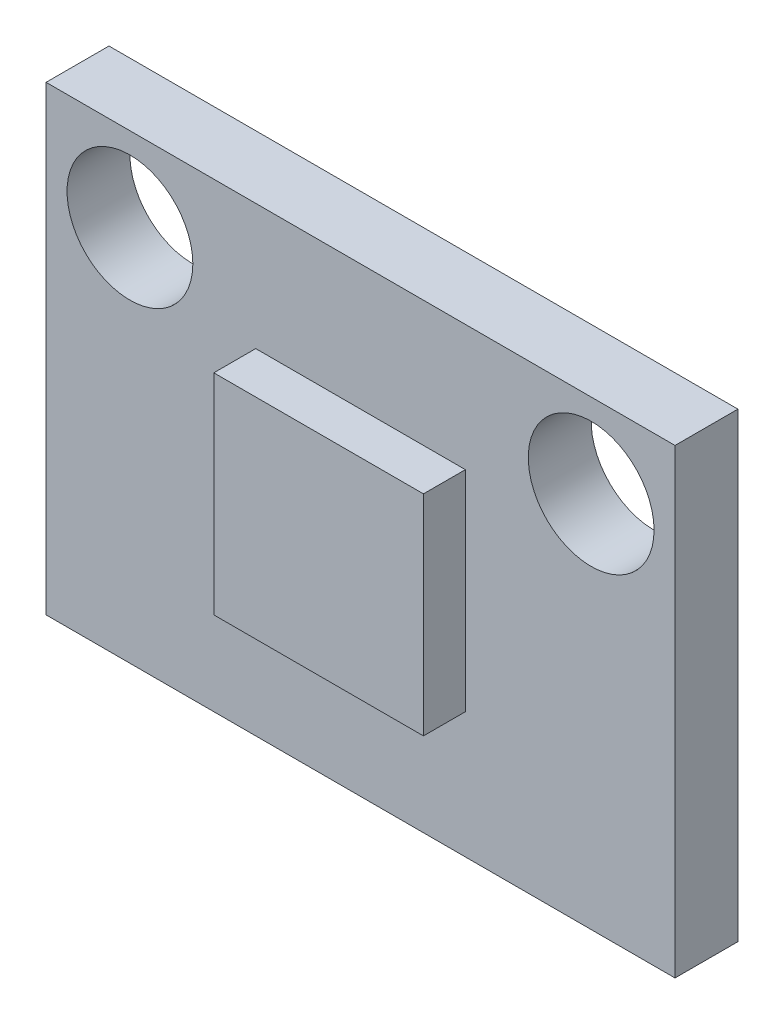
ISO-10303-21;
HEADER;
FILE_DESCRIPTION(('STEP AP214'),'2;1');
FILE_NAME('part.step','',(''),(''),'','','');
FILE_SCHEMA(('AUTOMOTIVE_DESIGN { 1 0 10303 214 1 1 1 1 }'));
ENDSEC;
DATA;
#1=APPLICATION_CONTEXT('core data for automotive mechanical design processes');
#2=APPLICATION_PROTOCOL_DEFINITION('international standard','automotive_design',2000,#1);
#3=PRODUCT_CONTEXT('',#1,'mechanical');
#4=PRODUCT('Part','Part','',(#3));
#5=PRODUCT_RELATED_PRODUCT_CATEGORY('part','',(#4));
#6=PRODUCT_DEFINITION_FORMATION('','',#4);
#7=PRODUCT_DEFINITION_CONTEXT('part definition',#1,'design');
#8=PRODUCT_DEFINITION('design','',#6,#7);
#9=PRODUCT_DEFINITION_SHAPE('','',#8);
#10=(LENGTH_UNIT() NAMED_UNIT(*) SI_UNIT(.MILLI.,.METRE.));
#11=(NAMED_UNIT(*) PLANE_ANGLE_UNIT() SI_UNIT($,.RADIAN.));
#12=(NAMED_UNIT(*) SI_UNIT($,.STERADIAN.) SOLID_ANGLE_UNIT());
#13=UNCERTAINTY_MEASURE_WITH_UNIT(LENGTH_MEASURE(1.E-05),#10,'distance_accuracy_value','');
#14=(GEOMETRIC_REPRESENTATION_CONTEXT(3) GLOBAL_UNCERTAINTY_ASSIGNED_CONTEXT((#13)) GLOBAL_UNIT_ASSIGNED_CONTEXT((#10,
#11,#12)) REPRESENTATION_CONTEXT('',''));
#15=CARTESIAN_POINT('',(0.,0.,0.));
#16=DIRECTION('',(0.,0.,1.));
#17=DIRECTION('',(1.,0.,0.));
#18=AXIS2_PLACEMENT_3D('',#15,#16,#17);
#19=CARTESIAN_POINT('',(0.,0.,1.5));
#20=DIRECTION('',(0.,0.,1.));
#21=DIRECTION('',(1.,0.,0.));
#22=AXIS2_PLACEMENT_3D('',#19,#20,#21);
#23=PLANE('',#22);
#24=CARTESIAN_POINT('',(-5.5,3.5,1.5));
#25=DIRECTION('',(0.,0.,1.));
#26=DIRECTION('',(1.,0.,0.));
#27=AXIS2_PLACEMENT_3D('',#24,#25,#26);
#28=CIRCLE('',#27,1.5);
#29=CARTESIAN_POINT('',(-4.,3.5,1.5));
#30=VERTEX_POINT('',#29);
#31=EDGE_CURVE('E148',#30,#30,#28,.T.);
#32=ORIENTED_EDGE('',*,*,#31,.F.);
#33=EDGE_LOOP('',(#32));
#34=FACE_BOUND('',#33,.T.);
#35=DIRECTION('',(0.,-1.,0.));
#36=VECTOR('',#35,1.);
#37=CARTESIAN_POINT('',(-7.5,-5.5,1.5));
#38=LINE('',#37,#36);
#39=CARTESIAN_POINT('',(-7.5,5.5,1.5));
#40=VERTEX_POINT('',#39);
#41=CARTESIAN_POINT('',(-7.5,-5.5,1.5));
#42=VERTEX_POINT('',#41);
#43=EDGE_CURVE('E156',#40,#42,#38,.T.);
#44=ORIENTED_EDGE('',*,*,#43,.T.);
#45=DIRECTION('',(1.,0.,0.));
#46=VECTOR('',#45,1.);
#47=CARTESIAN_POINT('',(7.5,-5.5,1.5));
#48=LINE('',#47,#46);
#49=CARTESIAN_POINT('',(7.5,-5.5,1.5));
#50=VERTEX_POINT('',#49);
#51=EDGE_CURVE('E88',#42,#50,#48,.T.);
#52=ORIENTED_EDGE('',*,*,#51,.T.);
#53=DIRECTION('',(0.,1.,0.));
#54=VECTOR('',#53,1.);
#55=CARTESIAN_POINT('',(7.5,-5.5,1.5));
#56=LINE('',#55,#54);
#57=CARTESIAN_POINT('',(7.5,5.5,1.5));
#58=VERTEX_POINT('',#57);
#59=EDGE_CURVE('E161',#50,#58,#56,.T.);
#60=ORIENTED_EDGE('',*,*,#59,.T.);
#61=DIRECTION('',(-1.,0.,0.));
#62=VECTOR('',#61,1.);
#63=CARTESIAN_POINT('',(7.5,5.5,1.5));
#64=LINE('',#63,#62);
#65=EDGE_CURVE('E60',#58,#40,#64,.T.);
#66=ORIENTED_EDGE('',*,*,#65,.T.);
#67=EDGE_LOOP('',(#44,#52,#60,#66));
#68=FACE_BOUND('',#67,.T.);
#69=CARTESIAN_POINT('',(5.5,3.5,1.5));
#70=DIRECTION('',(0.,0.,1.));
#71=DIRECTION('',(1.,0.,0.));
#72=AXIS2_PLACEMENT_3D('',#69,#70,#71);
#73=CIRCLE('',#72,1.5);
#74=CARTESIAN_POINT('',(7.,3.5,1.5));
#75=VERTEX_POINT('',#74);
#76=EDGE_CURVE('E139',#75,#75,#73,.T.);
#77=ORIENTED_EDGE('',*,*,#76,.F.);
#78=EDGE_LOOP('',(#77));
#79=FACE_BOUND('',#78,.T.);
#80=DIRECTION('',(1.,0.,0.));
#81=VECTOR('',#80,1.);
#82=CARTESIAN_POINT('',(2.5,-2.5,1.5));
#83=LINE('',#82,#81);
#84=CARTESIAN_POINT('',(-2.5,-2.5,1.5));
#85=VERTEX_POINT('',#84);
#86=CARTESIAN_POINT('',(2.5,-2.5,1.5));
#87=VERTEX_POINT('',#86);
#88=EDGE_CURVE('E305',#85,#87,#83,.T.);
#89=ORIENTED_EDGE('',*,*,#88,.F.);
#90=DIRECTION('',(0.,-1.,0.));
#91=VECTOR('',#90,1.);
#92=CARTESIAN_POINT('',(-2.5,-2.5,1.5));
#93=LINE('',#92,#91);
#94=CARTESIAN_POINT('',(-2.5,2.5,1.5));
#95=VERTEX_POINT('',#94);
#96=EDGE_CURVE('E133',#95,#85,#93,.T.);
#97=ORIENTED_EDGE('',*,*,#96,.F.);
#98=DIRECTION('',(-1.,0.,0.));
#99=VECTOR('',#98,1.);
#100=CARTESIAN_POINT('',(2.5,2.5,1.5));
#101=LINE('',#100,#99);
#102=CARTESIAN_POINT('',(2.5,2.5,1.5));
#103=VERTEX_POINT('',#102);
#104=EDGE_CURVE('E129',#103,#95,#101,.T.);
#105=ORIENTED_EDGE('',*,*,#104,.F.);
#106=DIRECTION('',(0.,1.,0.));
#107=VECTOR('',#106,1.);
#108=CARTESIAN_POINT('',(2.5,-2.5,1.5));
#109=LINE('',#108,#107);
#110=EDGE_CURVE('E302',#87,#103,#109,.T.);
#111=ORIENTED_EDGE('',*,*,#110,.F.);
#112=EDGE_LOOP('',(#89,#97,#105,#111));
#113=FACE_BOUND('',#112,.T.);
#114=ADVANCED_FACE('F36',(#34,#68,#79,#113),#23,.T.);
#115=CARTESIAN_POINT('',(0.,0.,0.));
#116=DIRECTION('',(0.,0.,1.));
#117=DIRECTION('',(1.,0.,0.));
#118=AXIS2_PLACEMENT_3D('',#115,#116,#117);
#119=PLANE('',#118);
#120=DIRECTION('',(0.,-1.,0.));
#121=VECTOR('',#120,1.);
#122=CARTESIAN_POINT('',(-7.5,-5.5,0.));
#123=LINE('',#122,#121);
#124=CARTESIAN_POINT('',(-7.5,5.5,0.));
#125=VERTEX_POINT('',#124);
#126=CARTESIAN_POINT('',(-7.5,-5.5,0.));
#127=VERTEX_POINT('',#126);
#128=EDGE_CURVE('E152',#125,#127,#123,.T.);
#129=ORIENTED_EDGE('',*,*,#128,.F.);
#130=DIRECTION('',(-1.,0.,0.));
#131=VECTOR('',#130,1.);
#132=CARTESIAN_POINT('',(7.5,5.5,0.));
#133=LINE('',#132,#131);
#134=CARTESIAN_POINT('',(7.5,5.5,0.));
#135=VERTEX_POINT('',#134);
#136=EDGE_CURVE('E81',#135,#125,#133,.T.);
#137=ORIENTED_EDGE('',*,*,#136,.F.);
#138=DIRECTION('',(0.,1.,0.));
#139=VECTOR('',#138,1.);
#140=CARTESIAN_POINT('',(7.5,-5.5,0.));
#141=LINE('',#140,#139);
#142=CARTESIAN_POINT('',(7.5,-5.5,0.));
#143=VERTEX_POINT('',#142);
#144=EDGE_CURVE('E172',#143,#135,#141,.T.);
#145=ORIENTED_EDGE('',*,*,#144,.F.);
#146=DIRECTION('',(1.,0.,0.));
#147=VECTOR('',#146,1.);
#148=CARTESIAN_POINT('',(7.5,-5.5,0.));
#149=LINE('',#148,#147);
#150=EDGE_CURVE('E169',#127,#143,#149,.T.);
#151=ORIENTED_EDGE('',*,*,#150,.F.);
#152=EDGE_LOOP('',(#129,#137,#145,#151));
#153=FACE_BOUND('',#152,.T.);
#154=CARTESIAN_POINT('',(-5.5,3.5,0.));
#155=DIRECTION('',(0.,0.,1.));
#156=DIRECTION('',(1.,0.,0.));
#157=AXIS2_PLACEMENT_3D('',#154,#155,#156);
#158=CIRCLE('',#157,1.5);
#159=CARTESIAN_POINT('',(-4.,3.5,0.));
#160=VERTEX_POINT('',#159);
#161=EDGE_CURVE('E146',#160,#160,#158,.T.);
#162=ORIENTED_EDGE('',*,*,#161,.T.);
#163=EDGE_LOOP('',(#162));
#164=FACE_BOUND('',#163,.T.);
#165=CARTESIAN_POINT('',(5.5,3.5,0.));
#166=DIRECTION('',(0.,0.,1.));
#167=DIRECTION('',(1.,0.,0.));
#168=AXIS2_PLACEMENT_3D('',#165,#166,#167);
#169=CIRCLE('',#168,1.5);
#170=CARTESIAN_POINT('',(7.,3.5,0.));
#171=VERTEX_POINT('',#170);
#172=EDGE_CURVE('E135',#171,#171,#169,.T.);
#173=ORIENTED_EDGE('',*,*,#172,.T.);
#174=EDGE_LOOP('',(#173));
#175=FACE_BOUND('',#174,.T.);
#176=ADVANCED_FACE('F187',(#153,#164,#175),#119,.F.);
#177=CARTESIAN_POINT('',(-7.5,-5.5,1.5));
#178=DIRECTION('',(1.,0.,0.));
#179=DIRECTION('',(0.,0.,-1.));
#180=AXIS2_PLACEMENT_3D('',#177,#178,#179);
#181=PLANE('',#180);
#182=ORIENTED_EDGE('',*,*,#128,.T.);
#183=DIRECTION('',(0.,0.,-1.));
#184=VECTOR('',#183,1.);
#185=CARTESIAN_POINT('',(-7.5,-5.5,1.5));
#186=LINE('',#185,#184);
#187=EDGE_CURVE('E11',#42,#127,#186,.T.);
#188=ORIENTED_EDGE('',*,*,#187,.F.);
#189=ORIENTED_EDGE('',*,*,#43,.F.);
#190=DIRECTION('',(0.,0.,-1.));
#191=VECTOR('',#190,1.);
#192=CARTESIAN_POINT('',(-7.5,5.5,1.5));
#193=LINE('',#192,#191);
#194=EDGE_CURVE('E166',#40,#125,#193,.T.);
#195=ORIENTED_EDGE('',*,*,#194,.T.);
#196=EDGE_LOOP('',(#182,#188,#189,#195));
#197=FACE_BOUND('',#196,.T.);
#198=ADVANCED_FACE('F38',(#197),#181,.F.);
#199=CARTESIAN_POINT('',(7.5,-5.5,1.5));
#200=DIRECTION('',(0.,1.,0.));
#201=DIRECTION('',(-1.,0.,0.));
#202=AXIS2_PLACEMENT_3D('',#199,#200,#201);
#203=PLANE('',#202);
#204=ORIENTED_EDGE('',*,*,#150,.T.);
#205=DIRECTION('',(0.,0.,-1.));
#206=VECTOR('',#205,1.);
#207=CARTESIAN_POINT('',(7.5,-5.5,1.5));
#208=LINE('',#207,#206);
#209=EDGE_CURVE('E44',#50,#143,#208,.T.);
#210=ORIENTED_EDGE('',*,*,#209,.F.);
#211=ORIENTED_EDGE('',*,*,#51,.F.);
#212=ORIENTED_EDGE('',*,*,#187,.T.);
#213=EDGE_LOOP('',(#204,#210,#211,#212));
#214=FACE_BOUND('',#213,.T.);
#215=ADVANCED_FACE('F203',(#214),#203,.F.);
#216=CARTESIAN_POINT('',(7.5,-5.5,1.5));
#217=DIRECTION('',(-1.,0.,0.));
#218=DIRECTION('',(0.,0.,1.));
#219=AXIS2_PLACEMENT_3D('',#216,#217,#218);
#220=PLANE('',#219);
#221=ORIENTED_EDGE('',*,*,#144,.T.);
#222=DIRECTION('',(0.,0.,-1.));
#223=VECTOR('',#222,1.);
#224=CARTESIAN_POINT('',(7.5,5.5,1.5));
#225=LINE('',#224,#223);
#226=EDGE_CURVE('E177',#58,#135,#225,.T.);
#227=ORIENTED_EDGE('',*,*,#226,.F.);
#228=ORIENTED_EDGE('',*,*,#59,.F.);
#229=ORIENTED_EDGE('',*,*,#209,.T.);
#230=EDGE_LOOP('',(#221,#227,#228,#229));
#231=FACE_BOUND('',#230,.T.);
#232=ADVANCED_FACE('F183',(#231),#220,.F.);
#233=CARTESIAN_POINT('',(7.5,5.5,1.5));
#234=DIRECTION('',(0.,-1.,0.));
#235=DIRECTION('',(1.,0.,0.));
#236=AXIS2_PLACEMENT_3D('',#233,#234,#235);
#237=PLANE('',#236);
#238=ORIENTED_EDGE('',*,*,#136,.T.);
#239=ORIENTED_EDGE('',*,*,#194,.F.);
#240=ORIENTED_EDGE('',*,*,#65,.F.);
#241=ORIENTED_EDGE('',*,*,#226,.T.);
#242=EDGE_LOOP('',(#238,#239,#240,#241));
#243=FACE_BOUND('',#242,.T.);
#244=ADVANCED_FACE('F192',(#243),#237,.F.);
#245=CARTESIAN_POINT('',(-5.5,3.5,1.5));
#246=DIRECTION('',(0.,0.,-1.));
#247=DIRECTION('',(-1.,0.,0.));
#248=AXIS2_PLACEMENT_3D('',#245,#246,#247);
#249=CYLINDRICAL_SURFACE('',#248,1.5);
#250=ORIENTED_EDGE('',*,*,#31,.T.);
#251=EDGE_LOOP('',(#250));
#252=FACE_BOUND('',#251,.T.);
#253=ORIENTED_EDGE('',*,*,#161,.F.);
#254=EDGE_LOOP('',(#253));
#255=FACE_BOUND('',#254,.T.);
#256=ADVANCED_FACE('F194',(#252,#255),#249,.F.);
#257=CARTESIAN_POINT('',(5.5,3.5,1.5));
#258=DIRECTION('',(0.,0.,-1.));
#259=DIRECTION('',(-1.,0.,0.));
#260=AXIS2_PLACEMENT_3D('',#257,#258,#259);
#261=CYLINDRICAL_SURFACE('',#260,1.5);
#262=ORIENTED_EDGE('',*,*,#76,.T.);
#263=EDGE_LOOP('',(#262));
#264=FACE_BOUND('',#263,.T.);
#265=ORIENTED_EDGE('',*,*,#172,.F.);
#266=EDGE_LOOP('',(#265));
#267=FACE_BOUND('',#266,.T.);
#268=ADVANCED_FACE('F200',(#264,#267),#261,.F.);
#269=CARTESIAN_POINT('',(-2.5,-2.5,2.5));
#270=DIRECTION('',(1.,0.,0.));
#271=DIRECTION('',(0.,0.,-1.));
#272=AXIS2_PLACEMENT_3D('',#269,#270,#271);
#273=PLANE('',#272);
#274=ORIENTED_EDGE('',*,*,#96,.T.);
#275=DIRECTION('',(0.,0.,-1.));
#276=VECTOR('',#275,1.);
#277=CARTESIAN_POINT('',(-2.5,-2.5,2.5));
#278=LINE('',#277,#276);
#279=CARTESIAN_POINT('',(-2.5,-2.5,2.5));
#280=VERTEX_POINT('',#279);
#281=EDGE_CURVE('E114',#280,#85,#278,.T.);
#282=ORIENTED_EDGE('',*,*,#281,.F.);
#283=DIRECTION('',(0.,-1.,0.));
#284=VECTOR('',#283,1.);
#285=CARTESIAN_POINT('',(-2.5,-2.5,2.5));
#286=LINE('',#285,#284);
#287=CARTESIAN_POINT('',(-2.5,2.5,2.5));
#288=VERTEX_POINT('',#287);
#289=EDGE_CURVE('E121',#288,#280,#286,.T.);
#290=ORIENTED_EDGE('',*,*,#289,.F.);
#291=DIRECTION('',(0.,0.,-1.));
#292=VECTOR('',#291,1.);
#293=CARTESIAN_POINT('',(-2.5,2.5,2.5));
#294=LINE('',#293,#292);
#295=EDGE_CURVE('E320',#288,#95,#294,.T.);
#296=ORIENTED_EDGE('',*,*,#295,.T.);
#297=EDGE_LOOP('',(#274,#282,#290,#296));
#298=FACE_BOUND('',#297,.T.);
#299=ADVANCED_FACE('F131',(#298),#273,.F.);
#300=CARTESIAN_POINT('',(2.5,-2.5,2.5));
#301=DIRECTION('',(0.,1.,0.));
#302=DIRECTION('',(-1.,0.,0.));
#303=AXIS2_PLACEMENT_3D('',#300,#301,#302);
#304=PLANE('',#303);
#305=ORIENTED_EDGE('',*,*,#88,.T.);
#306=DIRECTION('',(0.,0.,-1.));
#307=VECTOR('',#306,1.);
#308=CARTESIAN_POINT('',(2.5,-2.5,2.5));
#309=LINE('',#308,#307);
#310=CARTESIAN_POINT('',(2.5,-2.5,2.5));
#311=VERTEX_POINT('',#310);
#312=EDGE_CURVE('E117',#311,#87,#309,.T.);
#313=ORIENTED_EDGE('',*,*,#312,.F.);
#314=DIRECTION('',(1.,0.,0.));
#315=VECTOR('',#314,1.);
#316=CARTESIAN_POINT('',(2.5,-2.5,2.5));
#317=LINE('',#316,#315);
#318=EDGE_CURVE('E110',#280,#311,#317,.T.);
#319=ORIENTED_EDGE('',*,*,#318,.F.);
#320=ORIENTED_EDGE('',*,*,#281,.T.);
#321=EDGE_LOOP('',(#305,#313,#319,#320));
#322=FACE_BOUND('',#321,.T.);
#323=ADVANCED_FACE('F112',(#322),#304,.F.);
#324=CARTESIAN_POINT('',(2.5,-2.5,2.5));
#325=DIRECTION('',(-1.,0.,0.));
#326=DIRECTION('',(0.,0.,1.));
#327=AXIS2_PLACEMENT_3D('',#324,#325,#326);
#328=PLANE('',#327);
#329=ORIENTED_EDGE('',*,*,#110,.T.);
#330=DIRECTION('',(0.,0.,-1.));
#331=VECTOR('',#330,1.);
#332=CARTESIAN_POINT('',(2.5,2.5,2.5));
#333=LINE('',#332,#331);
#334=CARTESIAN_POINT('',(2.5,2.5,2.5));
#335=VERTEX_POINT('',#334);
#336=EDGE_CURVE('E51',#335,#103,#333,.T.);
#337=ORIENTED_EDGE('',*,*,#336,.F.);
#338=DIRECTION('',(0.,1.,0.));
#339=VECTOR('',#338,1.);
#340=CARTESIAN_POINT('',(2.5,-2.5,2.5));
#341=LINE('',#340,#339);
#342=EDGE_CURVE('E120',#311,#335,#341,.T.);
#343=ORIENTED_EDGE('',*,*,#342,.F.);
#344=ORIENTED_EDGE('',*,*,#312,.T.);
#345=EDGE_LOOP('',(#329,#337,#343,#344));
#346=FACE_BOUND('',#345,.T.);
#347=ADVANCED_FACE('F221',(#346),#328,.F.);
#348=CARTESIAN_POINT('',(2.5,2.5,2.5));
#349=DIRECTION('',(0.,-1.,0.));
#350=DIRECTION('',(0.,0.,-1.));
#351=AXIS2_PLACEMENT_3D('',#348,#349,#350);
#352=PLANE('',#351);
#353=ORIENTED_EDGE('',*,*,#104,.T.);
#354=ORIENTED_EDGE('',*,*,#295,.F.);
#355=DIRECTION('',(-1.,0.,0.));
#356=VECTOR('',#355,1.);
#357=CARTESIAN_POINT('',(2.5,2.5,2.5));
#358=LINE('',#357,#356);
#359=EDGE_CURVE('E125',#335,#288,#358,.T.);
#360=ORIENTED_EDGE('',*,*,#359,.F.);
#361=ORIENTED_EDGE('',*,*,#336,.T.);
#362=EDGE_LOOP('',(#353,#354,#360,#361));
#363=FACE_BOUND('',#362,.T.);
#364=ADVANCED_FACE('F224',(#363),#352,.F.);
#365=CARTESIAN_POINT('',(0.,0.,2.5));
#366=DIRECTION('',(0.,0.,1.));
#367=DIRECTION('',(1.,0.,0.));
#368=AXIS2_PLACEMENT_3D('',#365,#366,#367);
#369=PLANE('',#368);
#370=ORIENTED_EDGE('',*,*,#289,.T.);
#371=ORIENTED_EDGE('',*,*,#318,.T.);
#372=ORIENTED_EDGE('',*,*,#342,.T.);
#373=ORIENTED_EDGE('',*,*,#359,.T.);
#374=EDGE_LOOP('',(#370,#371,#372,#373));
#375=FACE_BOUND('',#374,.T.);
#376=ADVANCED_FACE('F124',(#375),#369,.T.);
#377=CLOSED_SHELL('',(#114,#176,#198,#215,#232,#244,#256,#268,#299,#323,#347,#364,#376));
#378=MANIFOLD_SOLID_BREP('B2',#377);
#379=ADVANCED_BREP_SHAPE_REPRESENTATION('',(#18,#378),#14);
#380=SHAPE_DEFINITION_REPRESENTATION(#9,#379);
ENDSEC;
END-ISO-10303-21;
